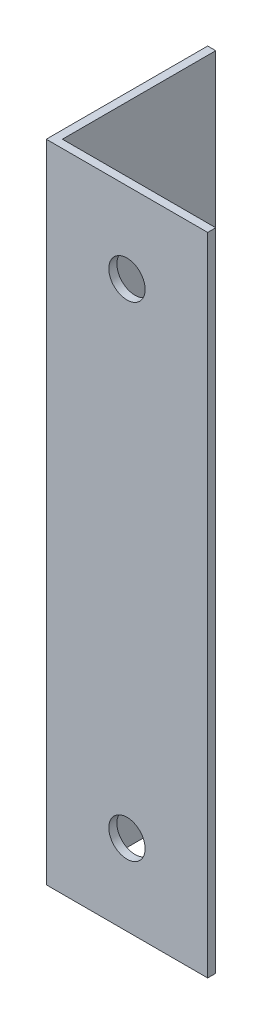
ISO-10303-21;
HEADER;
FILE_DESCRIPTION(('STEP AP214'),'2;1');
FILE_NAME('part.step','',(''),(''),'','','');
FILE_SCHEMA(('AUTOMOTIVE_DESIGN { 1 0 10303 214 1 1 1 1 }'));
ENDSEC;
DATA;
#1=APPLICATION_CONTEXT('core data for automotive mechanical design processes');
#2=APPLICATION_PROTOCOL_DEFINITION('international standard','automotive_design',2000,#1);
#3=PRODUCT_CONTEXT('',#1,'mechanical');
#4=PRODUCT('Part','Part','',(#3));
#5=PRODUCT_RELATED_PRODUCT_CATEGORY('part','',(#4));
#6=PRODUCT_DEFINITION_FORMATION('','',#4);
#7=PRODUCT_DEFINITION_CONTEXT('part definition',#1,'design');
#8=PRODUCT_DEFINITION('design','',#6,#7);
#9=PRODUCT_DEFINITION_SHAPE('','',#8);
#10=(LENGTH_UNIT() NAMED_UNIT(*) SI_UNIT(.MILLI.,.METRE.));
#11=(NAMED_UNIT(*) PLANE_ANGLE_UNIT() SI_UNIT($,.RADIAN.));
#12=(NAMED_UNIT(*) SI_UNIT($,.STERADIAN.) SOLID_ANGLE_UNIT());
#13=UNCERTAINTY_MEASURE_WITH_UNIT(LENGTH_MEASURE(1.E-05),#10,'distance_accuracy_value','');
#14=(GEOMETRIC_REPRESENTATION_CONTEXT(3) GLOBAL_UNCERTAINTY_ASSIGNED_CONTEXT((#13)) GLOBAL_UNIT_ASSIGNED_CONTEXT((#10,
#11,#12)) REPRESENTATION_CONTEXT('',''));
#15=CARTESIAN_POINT('',(0.,0.,0.));
#16=DIRECTION('',(0.,0.,1.));
#17=DIRECTION('',(1.,0.,0.));
#18=AXIS2_PLACEMENT_3D('',#15,#16,#17);
#19=CARTESIAN_POINT('',(20.,80.,0.));
#20=DIRECTION('',(0.,0.,-1.));
#21=DIRECTION('',(-1.,0.,0.));
#22=AXIS2_PLACEMENT_3D('',#19,#20,#21);
#23=PLANE('',#22);
#24=CARTESIAN_POINT('',(10.,9.99999999999999,0.));
#25=DIRECTION('',(0.,0.,-1.));
#26=DIRECTION('',(-1.,0.,0.));
#27=AXIS2_PLACEMENT_3D('',#24,#25,#26);
#28=CIRCLE('',#27,2.25);
#29=CARTESIAN_POINT('',(7.75,9.99999999999999,0.));
#30=VERTEX_POINT('',#29);
#31=EDGE_CURVE('E162',#30,#30,#28,.T.);
#32=ORIENTED_EDGE('',*,*,#31,.T.);
#33=EDGE_LOOP('',(#32));
#34=FACE_BOUND('',#33,.T.);
#35=CARTESIAN_POINT('',(10.,70.,0.));
#36=DIRECTION('',(0.,0.,-1.));
#37=DIRECTION('',(-1.,0.,0.));
#38=AXIS2_PLACEMENT_3D('',#35,#36,#37);
#39=CIRCLE('',#38,2.25);
#40=CARTESIAN_POINT('',(7.75,70.,0.));
#41=VERTEX_POINT('',#40);
#42=EDGE_CURVE('E123',#41,#41,#39,.T.);
#43=ORIENTED_EDGE('',*,*,#42,.T.);
#44=EDGE_LOOP('',(#43));
#45=FACE_BOUND('',#44,.T.);
#46=DIRECTION('',(1.,0.,0.));
#47=VECTOR('',#46,1.);
#48=CARTESIAN_POINT('',(20.,0.,0.));
#49=LINE('',#48,#47);
#50=CARTESIAN_POINT('',(0.,0.,0.));
#51=VERTEX_POINT('',#50);
#52=CARTESIAN_POINT('',(20.,0.,0.));
#53=VERTEX_POINT('',#52);
#54=EDGE_CURVE('E119',#51,#53,#49,.T.);
#55=ORIENTED_EDGE('',*,*,#54,.T.);
#56=DIRECTION('',(0.,-1.,0.));
#57=VECTOR('',#56,1.);
#58=CARTESIAN_POINT('',(20.,80.,0.));
#59=LINE('',#58,#57);
#60=CARTESIAN_POINT('',(20.,80.,0.));
#61=VERTEX_POINT('',#60);
#62=EDGE_CURVE('E11',#61,#53,#59,.T.);
#63=ORIENTED_EDGE('',*,*,#62,.F.);
#64=DIRECTION('',(1.,0.,0.));
#65=VECTOR('',#64,1.);
#66=CARTESIAN_POINT('',(20.,80.,0.));
#67=LINE('',#66,#65);
#68=CARTESIAN_POINT('',(0.,80.,0.));
#69=VERTEX_POINT('',#68);
#70=EDGE_CURVE('E130',#69,#61,#67,.T.);
#71=ORIENTED_EDGE('',*,*,#70,.F.);
#72=DIRECTION('',(0.,-1.,0.));
#73=VECTOR('',#72,1.);
#74=CARTESIAN_POINT('',(0.,80.,0.));
#75=LINE('',#74,#73);
#76=EDGE_CURVE('E115',#69,#51,#75,.T.);
#77=ORIENTED_EDGE('',*,*,#76,.T.);
#78=EDGE_LOOP('',(#55,#63,#71,#77));
#79=FACE_BOUND('',#78,.T.);
#80=ADVANCED_FACE('F35',(#34,#45,#79),#23,.F.);
#81=CARTESIAN_POINT('',(20.,80.,-0.999999999999998));
#82=DIRECTION('',(-1.,0.,0.));
#83=DIRECTION('',(0.,0.,1.));
#84=AXIS2_PLACEMENT_3D('',#81,#82,#83);
#85=PLANE('',#84);
#86=DIRECTION('',(0.,0.,-1.));
#87=VECTOR('',#86,1.);
#88=CARTESIAN_POINT('',(20.,0.,-0.999999999999998));
#89=LINE('',#88,#87);
#90=CARTESIAN_POINT('',(20.,0.,-0.999999999999998));
#91=VERTEX_POINT('',#90);
#92=EDGE_CURVE('E122',#53,#91,#89,.T.);
#93=ORIENTED_EDGE('',*,*,#92,.T.);
#94=DIRECTION('',(0.,-1.,0.));
#95=VECTOR('',#94,1.);
#96=CARTESIAN_POINT('',(20.,80.,-0.999999999999998));
#97=LINE('',#96,#95);
#98=CARTESIAN_POINT('',(20.,80.,-0.999999999999998));
#99=VERTEX_POINT('',#98);
#100=EDGE_CURVE('E43',#99,#91,#97,.T.);
#101=ORIENTED_EDGE('',*,*,#100,.F.);
#102=DIRECTION('',(0.,0.,-1.));
#103=VECTOR('',#102,1.);
#104=CARTESIAN_POINT('',(20.,80.,-0.999999999999998));
#105=LINE('',#104,#103);
#106=EDGE_CURVE('E88',#61,#99,#105,.T.);
#107=ORIENTED_EDGE('',*,*,#106,.F.);
#108=ORIENTED_EDGE('',*,*,#62,.T.);
#109=EDGE_LOOP('',(#93,#101,#107,#108));
#110=FACE_BOUND('',#109,.T.);
#111=ADVANCED_FACE('F154',(#110),#85,.F.);
#112=CARTESIAN_POINT('',(1.,80.,-0.999999999999997));
#113=DIRECTION('',(0.,0.,1.));
#114=DIRECTION('',(1.,0.,0.));
#115=AXIS2_PLACEMENT_3D('',#112,#113,#114);
#116=PLANE('',#115);
#117=CARTESIAN_POINT('',(10.,9.99999999999999,-0.999999999999998));
#118=DIRECTION('',(0.,0.,-1.));
#119=DIRECTION('',(-1.,0.,0.));
#120=AXIS2_PLACEMENT_3D('',#117,#118,#119);
#121=CIRCLE('',#120,2.25);
#122=CARTESIAN_POINT('',(7.75,9.99999999999999,-0.999999999999998));
#123=VERTEX_POINT('',#122);
#124=EDGE_CURVE('E171',#123,#123,#121,.T.);
#125=ORIENTED_EDGE('',*,*,#124,.F.);
#126=EDGE_LOOP('',(#125));
#127=FACE_BOUND('',#126,.T.);
#128=CARTESIAN_POINT('',(10.,70.,-0.999999999999998));
#129=DIRECTION('',(0.,0.,-1.));
#130=DIRECTION('',(-1.,0.,0.));
#131=AXIS2_PLACEMENT_3D('',#128,#129,#130);
#132=CIRCLE('',#131,2.25);
#133=CARTESIAN_POINT('',(7.75,70.,-0.999999999999998));
#134=VERTEX_POINT('',#133);
#135=EDGE_CURVE('E166',#134,#134,#132,.T.);
#136=ORIENTED_EDGE('',*,*,#135,.F.);
#137=EDGE_LOOP('',(#136));
#138=FACE_BOUND('',#137,.T.);
#139=DIRECTION('',(-1.,0.,0.));
#140=VECTOR('',#139,1.);
#141=CARTESIAN_POINT('',(1.,0.,-0.999999999999997));
#142=LINE('',#141,#140);
#143=CARTESIAN_POINT('',(1.,0.,-0.999999999999997));
#144=VERTEX_POINT('',#143);
#145=EDGE_CURVE('E125',#91,#144,#142,.T.);
#146=ORIENTED_EDGE('',*,*,#145,.T.);
#147=DIRECTION('',(0.,-1.,0.));
#148=VECTOR('',#147,1.);
#149=CARTESIAN_POINT('',(1.,80.,-0.999999999999997));
#150=LINE('',#149,#148);
#151=CARTESIAN_POINT('',(1.,80.,-0.999999999999997));
#152=VERTEX_POINT('',#151);
#153=EDGE_CURVE('E110',#152,#144,#150,.T.);
#154=ORIENTED_EDGE('',*,*,#153,.F.);
#155=DIRECTION('',(-1.,0.,0.));
#156=VECTOR('',#155,1.);
#157=CARTESIAN_POINT('',(1.,80.,-0.999999999999997));
#158=LINE('',#157,#156);
#159=EDGE_CURVE('E101',#99,#152,#158,.T.);
#160=ORIENTED_EDGE('',*,*,#159,.F.);
#161=ORIENTED_EDGE('',*,*,#100,.T.);
#162=EDGE_LOOP('',(#146,#154,#160,#161));
#163=FACE_BOUND('',#162,.T.);
#164=ADVANCED_FACE('F136',(#127,#138,#163),#116,.F.);
#165=CARTESIAN_POINT('',(0.999999999999998,80.,-20.));
#166=DIRECTION('',(-1.,0.,0.));
#167=DIRECTION('',(0.,0.,1.));
#168=AXIS2_PLACEMENT_3D('',#165,#166,#167);
#169=PLANE('',#168);
#170=DIRECTION('',(0.,0.,-1.));
#171=VECTOR('',#170,1.);
#172=CARTESIAN_POINT('',(0.999999999999998,0.,-20.));
#173=LINE('',#172,#171);
#174=CARTESIAN_POINT('',(0.999999999999998,0.,-20.));
#175=VERTEX_POINT('',#174);
#176=EDGE_CURVE('E109',#144,#175,#173,.T.);
#177=ORIENTED_EDGE('',*,*,#176,.T.);
#178=DIRECTION('',(0.,-1.,0.));
#179=VECTOR('',#178,1.);
#180=CARTESIAN_POINT('',(0.999999999999998,80.,-20.));
#181=LINE('',#180,#179);
#182=CARTESIAN_POINT('',(0.999999999999998,80.,-20.));
#183=VERTEX_POINT('',#182);
#184=EDGE_CURVE('E106',#183,#175,#181,.T.);
#185=ORIENTED_EDGE('',*,*,#184,.F.);
#186=DIRECTION('',(0.,0.,-1.));
#187=VECTOR('',#186,1.);
#188=CARTESIAN_POINT('',(0.999999999999998,80.,-20.));
#189=LINE('',#188,#187);
#190=EDGE_CURVE('E95',#152,#183,#189,.T.);
#191=ORIENTED_EDGE('',*,*,#190,.F.);
#192=ORIENTED_EDGE('',*,*,#153,.T.);
#193=EDGE_LOOP('',(#177,#185,#191,#192));
#194=FACE_BOUND('',#193,.T.);
#195=ADVANCED_FACE('F107',(#194),#169,.F.);
#196=CARTESIAN_POINT('',(0.,80.,-20.));
#197=DIRECTION('',(0.,0.,1.));
#198=DIRECTION('',(1.,0.,0.));
#199=AXIS2_PLACEMENT_3D('',#196,#197,#198);
#200=PLANE('',#199);
#201=DIRECTION('',(-1.,0.,0.));
#202=VECTOR('',#201,1.);
#203=CARTESIAN_POINT('',(0.,0.,-20.));
#204=LINE('',#203,#202);
#205=CARTESIAN_POINT('',(0.,0.,-20.));
#206=VERTEX_POINT('',#205);
#207=EDGE_CURVE('E74',#175,#206,#204,.T.);
#208=ORIENTED_EDGE('',*,*,#207,.T.);
#209=DIRECTION('',(0.,-1.,0.));
#210=VECTOR('',#209,1.);
#211=CARTESIAN_POINT('',(0.,80.,-20.));
#212=LINE('',#211,#210);
#213=CARTESIAN_POINT('',(0.,80.,-20.));
#214=VERTEX_POINT('',#213);
#215=EDGE_CURVE('E111',#214,#206,#212,.T.);
#216=ORIENTED_EDGE('',*,*,#215,.F.);
#217=DIRECTION('',(-1.,0.,0.));
#218=VECTOR('',#217,1.);
#219=CARTESIAN_POINT('',(0.,80.,-20.));
#220=LINE('',#219,#218);
#221=EDGE_CURVE('E99',#183,#214,#220,.T.);
#222=ORIENTED_EDGE('',*,*,#221,.F.);
#223=ORIENTED_EDGE('',*,*,#184,.T.);
#224=EDGE_LOOP('',(#208,#216,#222,#223));
#225=FACE_BOUND('',#224,.T.);
#226=ADVANCED_FACE('F113',(#225),#200,.F.);
#227=CARTESIAN_POINT('',(0.,80.,0.));
#228=DIRECTION('',(1.,0.,0.));
#229=DIRECTION('',(0.,0.,-1.));
#230=AXIS2_PLACEMENT_3D('',#227,#228,#229);
#231=PLANE('',#230);
#232=DIRECTION('',(0.,0.,1.));
#233=VECTOR('',#232,1.);
#234=CARTESIAN_POINT('',(0.,0.,0.));
#235=LINE('',#234,#233);
#236=EDGE_CURVE('E80',#206,#51,#235,.T.);
#237=ORIENTED_EDGE('',*,*,#236,.T.);
#238=ORIENTED_EDGE('',*,*,#76,.F.);
#239=DIRECTION('',(0.,0.,1.));
#240=VECTOR('',#239,1.);
#241=CARTESIAN_POINT('',(0.,80.,0.));
#242=LINE('',#241,#240);
#243=EDGE_CURVE('E51',#214,#69,#242,.T.);
#244=ORIENTED_EDGE('',*,*,#243,.F.);
#245=ORIENTED_EDGE('',*,*,#215,.T.);
#246=EDGE_LOOP('',(#237,#238,#244,#245));
#247=FACE_BOUND('',#246,.T.);
#248=ADVANCED_FACE('F143',(#247),#231,.F.);
#249=CARTESIAN_POINT('',(0.,80.,0.));
#250=DIRECTION('',(0.,-1.,0.));
#251=DIRECTION('',(0.,0.,-1.));
#252=AXIS2_PLACEMENT_3D('',#249,#250,#251);
#253=PLANE('',#252);
#254=ORIENTED_EDGE('',*,*,#70,.T.);
#255=ORIENTED_EDGE('',*,*,#106,.T.);
#256=ORIENTED_EDGE('',*,*,#159,.T.);
#257=ORIENTED_EDGE('',*,*,#190,.T.);
#258=ORIENTED_EDGE('',*,*,#221,.T.);
#259=ORIENTED_EDGE('',*,*,#243,.T.);
#260=EDGE_LOOP('',(#254,#255,#256,#257,#258,#259));
#261=FACE_BOUND('',#260,.T.);
#262=ADVANCED_FACE('F97',(#261),#253,.F.);
#263=CARTESIAN_POINT('',(0.,0.,0.));
#264=DIRECTION('',(0.,-1.,0.));
#265=DIRECTION('',(0.,0.,-1.));
#266=AXIS2_PLACEMENT_3D('',#263,#264,#265);
#267=PLANE('',#266);
#268=ORIENTED_EDGE('',*,*,#54,.F.);
#269=ORIENTED_EDGE('',*,*,#236,.F.);
#270=ORIENTED_EDGE('',*,*,#207,.F.);
#271=ORIENTED_EDGE('',*,*,#176,.F.);
#272=ORIENTED_EDGE('',*,*,#145,.F.);
#273=ORIENTED_EDGE('',*,*,#92,.F.);
#274=EDGE_LOOP('',(#268,#269,#270,#271,#272,#273));
#275=FACE_BOUND('',#274,.T.);
#276=ADVANCED_FACE('F139',(#275),#267,.T.);
#277=CARTESIAN_POINT('',(10.,70.,0.));
#278=DIRECTION('',(0.,0.,-1.));
#279=DIRECTION('',(-1.,0.,0.));
#280=AXIS2_PLACEMENT_3D('',#277,#278,#279);
#281=CYLINDRICAL_SURFACE('',#280,2.25);
#282=ORIENTED_EDGE('',*,*,#42,.F.);
#283=EDGE_LOOP('',(#282));
#284=FACE_BOUND('',#283,.T.);
#285=ORIENTED_EDGE('',*,*,#135,.T.);
#286=EDGE_LOOP('',(#285));
#287=FACE_BOUND('',#286,.T.);
#288=ADVANCED_FACE('F185',(#284,#287),#281,.F.);
#289=CARTESIAN_POINT('',(10.,9.99999999999999,0.));
#290=DIRECTION('',(0.,0.,-1.));
#291=DIRECTION('',(-1.,0.,0.));
#292=AXIS2_PLACEMENT_3D('',#289,#290,#291);
#293=CYLINDRICAL_SURFACE('',#292,2.25);
#294=ORIENTED_EDGE('',*,*,#31,.F.);
#295=EDGE_LOOP('',(#294));
#296=FACE_BOUND('',#295,.T.);
#297=ORIENTED_EDGE('',*,*,#124,.T.);
#298=EDGE_LOOP('',(#297));
#299=FACE_BOUND('',#298,.T.);
#300=ADVANCED_FACE('F178',(#296,#299),#293,.F.);
#301=CLOSED_SHELL('',(#80,#111,#164,#195,#226,#248,#262,#276,#288,#300));
#302=MANIFOLD_SOLID_BREP('B2',#301);
#303=ADVANCED_BREP_SHAPE_REPRESENTATION('',(#18,#302),#14);
#304=SHAPE_DEFINITION_REPRESENTATION(#9,#303);
ENDSEC;
END-ISO-10303-21;
